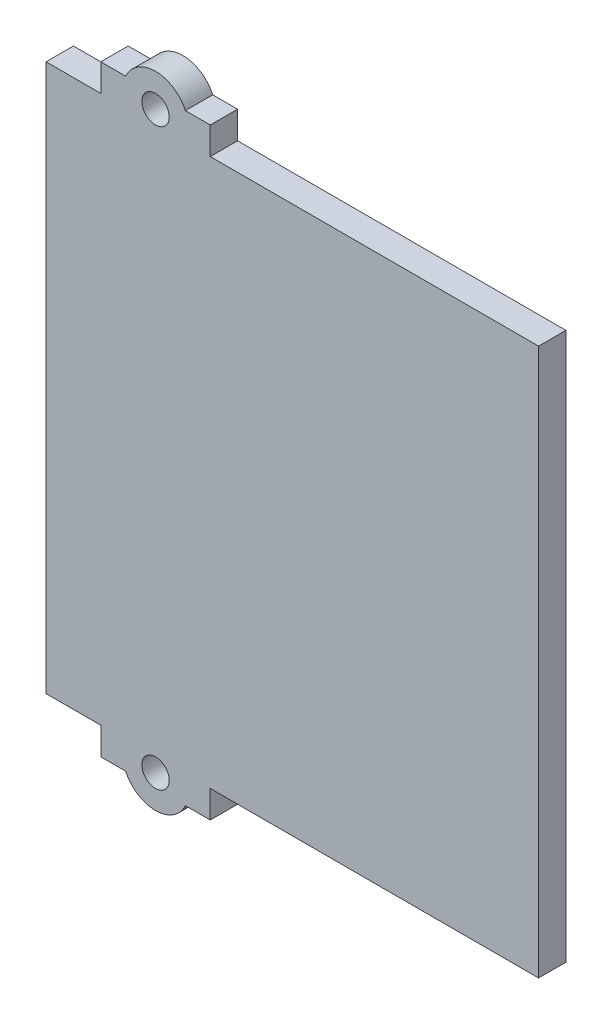
ISO-10303-21;
HEADER;
FILE_DESCRIPTION(('STEP AP214'),'2;1');
FILE_NAME('part.step','',(''),(''),'','','');
FILE_SCHEMA(('AUTOMOTIVE_DESIGN { 1 0 10303 214 1 1 1 1 }'));
ENDSEC;
DATA;
#1=APPLICATION_CONTEXT('core data for automotive mechanical design processes');
#2=APPLICATION_PROTOCOL_DEFINITION('international standard','automotive_design',2000,#1);
#3=PRODUCT_CONTEXT('',#1,'mechanical');
#4=PRODUCT('Part','Part','',(#3));
#5=PRODUCT_RELATED_PRODUCT_CATEGORY('part','',(#4));
#6=PRODUCT_DEFINITION_FORMATION('','',#4);
#7=PRODUCT_DEFINITION_CONTEXT('part definition',#1,'design');
#8=PRODUCT_DEFINITION('design','',#6,#7);
#9=PRODUCT_DEFINITION_SHAPE('','',#8);
#10=(LENGTH_UNIT() NAMED_UNIT(*) SI_UNIT(.MILLI.,.METRE.));
#11=(NAMED_UNIT(*) PLANE_ANGLE_UNIT() SI_UNIT($,.RADIAN.));
#12=(NAMED_UNIT(*) SI_UNIT($,.STERADIAN.) SOLID_ANGLE_UNIT());
#13=UNCERTAINTY_MEASURE_WITH_UNIT(LENGTH_MEASURE(1.E-05),#10,'distance_accuracy_value','');
#14=(GEOMETRIC_REPRESENTATION_CONTEXT(3) GLOBAL_UNCERTAINTY_ASSIGNED_CONTEXT((#13)) GLOBAL_UNIT_ASSIGNED_CONTEXT((#10,
#11,#12)) REPRESENTATION_CONTEXT('',''));
#15=CARTESIAN_POINT('',(0.,0.,0.));
#16=DIRECTION('',(0.,0.,1.));
#17=DIRECTION('',(1.,0.,0.));
#18=AXIS2_PLACEMENT_3D('',#15,#16,#17);
#19=CARTESIAN_POINT('',(0.,-55.,0.));
#20=DIRECTION('',(0.,1.,0.));
#21=DIRECTION('',(0.,0.,-1.));
#22=AXIS2_PLACEMENT_3D('',#19,#20,#21);
#23=PLANE('',#22);
#24=DIRECTION('',(0.,0.,1.));
#25=VECTOR('',#24,1.);
#26=CARTESIAN_POINT('',(-30.4543560573178,-55.,0.));
#27=LINE('',#26,#25);
#28=CARTESIAN_POINT('',(-30.4543560573178,-55.,5.));
#29=VERTEX_POINT('',#28);
#30=CARTESIAN_POINT('',(-30.4543560573178,-55.,0.));
#31=VERTEX_POINT('',#30);
#32=EDGE_CURVE('E11',#29,#31,#27,.F.);
#33=ORIENTED_EDGE('',*,*,#32,.F.);
#34=DIRECTION('',(1.,0.,0.));
#35=VECTOR('',#34,1.);
#36=CARTESIAN_POINT('',(-35.,-55.,5.));
#37=LINE('',#36,#35);
#38=CARTESIAN_POINT('',(-35.,-55.,5.));
#39=VERTEX_POINT('',#38);
#40=EDGE_CURVE('E159',#39,#29,#37,.T.);
#41=ORIENTED_EDGE('',*,*,#40,.F.);
#42=DIRECTION('',(0.,0.,1.));
#43=VECTOR('',#42,1.);
#44=CARTESIAN_POINT('',(-35.,-55.,5.));
#45=LINE('',#44,#43);
#46=CARTESIAN_POINT('',(-35.,-55.,0.));
#47=VERTEX_POINT('',#46);
#48=EDGE_CURVE('E180',#47,#39,#45,.T.);
#49=ORIENTED_EDGE('',*,*,#48,.F.);
#50=DIRECTION('',(-1.,0.,0.));
#51=VECTOR('',#50,1.);
#52=CARTESIAN_POINT('',(-35.,-55.,0.));
#53=LINE('',#52,#51);
#54=EDGE_CURVE('E160',#31,#47,#53,.T.);
#55=ORIENTED_EDGE('',*,*,#54,.F.);
#56=EDGE_LOOP('',(#33,#41,#49,#55));
#57=FACE_BOUND('',#56,.T.);
#58=ADVANCED_FACE('F37',(#57),#23,.F.);
#59=DIRECTION('',(0.,0.,1.));
#60=VECTOR('',#59,1.);
#61=CARTESIAN_POINT('',(-19.5456439426821,-55.,0.));
#62=LINE('',#61,#60);
#63=CARTESIAN_POINT('',(-19.5456439426821,-55.,0.));
#64=VERTEX_POINT('',#63);
#65=CARTESIAN_POINT('',(-19.5456439426821,-55.,5.));
#66=VERTEX_POINT('',#65);
#67=EDGE_CURVE('E45',#64,#66,#62,.T.);
#68=ORIENTED_EDGE('',*,*,#67,.F.);
#69=CARTESIAN_POINT('',(-15.,-55.,0.));
#70=VERTEX_POINT('',#69);
#71=EDGE_CURVE('E275',#70,#64,#53,.T.);
#72=ORIENTED_EDGE('',*,*,#71,.F.);
#73=DIRECTION('',(0.,0.,-1.));
#74=VECTOR('',#73,1.);
#75=CARTESIAN_POINT('',(-15.,-55.,5.));
#76=LINE('',#75,#74);
#77=CARTESIAN_POINT('',(-15.,-55.,5.));
#78=VERTEX_POINT('',#77);
#79=EDGE_CURVE('E170',#78,#70,#76,.T.);
#80=ORIENTED_EDGE('',*,*,#79,.F.);
#81=EDGE_CURVE('E166',#66,#78,#37,.T.);
#82=ORIENTED_EDGE('',*,*,#81,.F.);
#83=EDGE_LOOP('',(#68,#72,#80,#82));
#84=FACE_BOUND('',#83,.T.);
#85=ADVANCED_FACE('F313',(#84),#23,.F.);
#86=CARTESIAN_POINT('',(0.,55.,0.));
#87=DIRECTION('',(0.,-1.,0.));
#88=DIRECTION('',(0.,0.,-1.));
#89=AXIS2_PLACEMENT_3D('',#86,#87,#88);
#90=PLANE('',#89);
#91=DIRECTION('',(-1.,0.,0.));
#92=VECTOR('',#91,1.);
#93=CARTESIAN_POINT('',(-35.,55.,0.));
#94=LINE('',#93,#92);
#95=CARTESIAN_POINT('',(-15.,55.,0.));
#96=VERTEX_POINT('',#95);
#97=CARTESIAN_POINT('',(-19.5456439426821,55.,0.));
#98=VERTEX_POINT('',#97);
#99=EDGE_CURVE('E198',#96,#98,#94,.T.);
#100=ORIENTED_EDGE('',*,*,#99,.T.);
#101=DIRECTION('',(0.,0.,1.));
#102=VECTOR('',#101,1.);
#103=CARTESIAN_POINT('',(-19.5456439426821,55.,0.));
#104=LINE('',#103,#102);
#105=CARTESIAN_POINT('',(-19.5456439426821,55.,5.));
#106=VERTEX_POINT('',#105);
#107=EDGE_CURVE('E253',#98,#106,#104,.T.);
#108=ORIENTED_EDGE('',*,*,#107,.T.);
#109=DIRECTION('',(1.,0.,0.));
#110=VECTOR('',#109,1.);
#111=CARTESIAN_POINT('',(-35.,55.,5.));
#112=LINE('',#111,#110);
#113=CARTESIAN_POINT('',(-15.,55.,5.));
#114=VERTEX_POINT('',#113);
#115=EDGE_CURVE('E191',#106,#114,#112,.T.);
#116=ORIENTED_EDGE('',*,*,#115,.T.);
#117=DIRECTION('',(0.,0.,-1.));
#118=VECTOR('',#117,1.);
#119=CARTESIAN_POINT('',(-15.,55.,5.));
#120=LINE('',#119,#118);
#121=EDGE_CURVE('E195',#114,#96,#120,.T.);
#122=ORIENTED_EDGE('',*,*,#121,.T.);
#123=EDGE_LOOP('',(#100,#108,#116,#122));
#124=FACE_BOUND('',#123,.T.);
#125=ADVANCED_FACE('F258',(#124),#90,.F.);
#126=CARTESIAN_POINT('',(45.,-50.,5.));
#127=DIRECTION('',(0.,1.,0.));
#128=DIRECTION('',(-1.,0.,0.));
#129=AXIS2_PLACEMENT_3D('',#126,#127,#128);
#130=PLANE('',#129);
#131=DIRECTION('',(1.,0.,0.));
#132=VECTOR('',#131,1.);
#133=CARTESIAN_POINT('',(45.,-50.,0.));
#134=LINE('',#133,#132);
#135=CARTESIAN_POINT('',(-45.,-50.,0.));
#136=VERTEX_POINT('',#135);
#137=CARTESIAN_POINT('',(-35.,-50.,0.));
#138=VERTEX_POINT('',#137);
#139=EDGE_CURVE('E234',#136,#138,#134,.T.);
#140=ORIENTED_EDGE('',*,*,#139,.T.);
#141=DIRECTION('',(0.,0.,1.));
#142=VECTOR('',#141,1.);
#143=CARTESIAN_POINT('',(-35.,-50.,5.));
#144=LINE('',#143,#142);
#145=CARTESIAN_POINT('',(-35.,-50.,5.));
#146=VERTEX_POINT('',#145);
#147=EDGE_CURVE('E174',#138,#146,#144,.T.);
#148=ORIENTED_EDGE('',*,*,#147,.T.);
#149=DIRECTION('',(1.,0.,0.));
#150=VECTOR('',#149,1.);
#151=CARTESIAN_POINT('',(45.,-50.,5.));
#152=LINE('',#151,#150);
#153=CARTESIAN_POINT('',(-45.,-50.,5.));
#154=VERTEX_POINT('',#153);
#155=EDGE_CURVE('E222',#154,#146,#152,.T.);
#156=ORIENTED_EDGE('',*,*,#155,.F.);
#157=DIRECTION('',(0.,0.,-1.));
#158=VECTOR('',#157,1.);
#159=CARTESIAN_POINT('',(-45.,-50.,5.));
#160=LINE('',#159,#158);
#161=EDGE_CURVE('E249',#154,#136,#160,.T.);
#162=ORIENTED_EDGE('',*,*,#161,.T.);
#163=EDGE_LOOP('',(#140,#148,#156,#162));
#164=FACE_BOUND('',#163,.T.);
#165=ADVANCED_FACE('F286',(#164),#130,.F.);
#166=CARTESIAN_POINT('',(45.,50.,5.));
#167=DIRECTION('',(0.,-1.,0.));
#168=DIRECTION('',(1.,0.,0.));
#169=AXIS2_PLACEMENT_3D('',#166,#167,#168);
#170=PLANE('',#169);
#171=DIRECTION('',(0.,0.,1.));
#172=VECTOR('',#171,1.);
#173=CARTESIAN_POINT('',(-35.,50.,5.));
#174=LINE('',#173,#172);
#175=CARTESIAN_POINT('',(-35.,50.,0.));
#176=VERTEX_POINT('',#175);
#177=CARTESIAN_POINT('',(-35.,50.,5.));
#178=VERTEX_POINT('',#177);
#179=EDGE_CURVE('E187',#176,#178,#174,.T.);
#180=ORIENTED_EDGE('',*,*,#179,.F.);
#181=DIRECTION('',(-1.,0.,0.));
#182=VECTOR('',#181,1.);
#183=CARTESIAN_POINT('',(45.,50.,0.));
#184=LINE('',#183,#182);
#185=CARTESIAN_POINT('',(-45.,50.,0.));
#186=VERTEX_POINT('',#185);
#187=EDGE_CURVE('E239',#176,#186,#184,.T.);
#188=ORIENTED_EDGE('',*,*,#187,.T.);
#189=DIRECTION('',(0.,0.,-1.));
#190=VECTOR('',#189,1.);
#191=CARTESIAN_POINT('',(-45.,50.,5.));
#192=LINE('',#191,#190);
#193=CARTESIAN_POINT('',(-45.,50.,5.));
#194=VERTEX_POINT('',#193);
#195=EDGE_CURVE('E230',#194,#186,#192,.T.);
#196=ORIENTED_EDGE('',*,*,#195,.F.);
#197=DIRECTION('',(-1.,0.,0.));
#198=VECTOR('',#197,1.);
#199=CARTESIAN_POINT('',(45.,50.,5.));
#200=LINE('',#199,#198);
#201=EDGE_CURVE('E226',#178,#194,#200,.T.);
#202=ORIENTED_EDGE('',*,*,#201,.F.);
#203=EDGE_LOOP('',(#180,#188,#196,#202));
#204=FACE_BOUND('',#203,.T.);
#205=ADVANCED_FACE('F295',(#204),#170,.F.);
#206=DIRECTION('',(0.,0.,-1.));
#207=VECTOR('',#206,1.);
#208=CARTESIAN_POINT('',(-15.,50.,5.));
#209=LINE('',#208,#207);
#210=CARTESIAN_POINT('',(-15.,50.,5.));
#211=VERTEX_POINT('',#210);
#212=CARTESIAN_POINT('',(-15.,50.,0.));
#213=VERTEX_POINT('',#212);
#214=EDGE_CURVE('E192',#211,#213,#209,.T.);
#215=ORIENTED_EDGE('',*,*,#214,.F.);
#216=CARTESIAN_POINT('',(45.,50.,5.));
#217=VERTEX_POINT('',#216);
#218=EDGE_CURVE('E227',#217,#211,#200,.T.);
#219=ORIENTED_EDGE('',*,*,#218,.F.);
#220=DIRECTION('',(0.,0.,-1.));
#221=VECTOR('',#220,1.);
#222=CARTESIAN_POINT('',(45.,50.,5.));
#223=LINE('',#222,#221);
#224=CARTESIAN_POINT('',(45.,50.,0.));
#225=VERTEX_POINT('',#224);
#226=EDGE_CURVE('E243',#217,#225,#223,.T.);
#227=ORIENTED_EDGE('',*,*,#226,.T.);
#228=EDGE_CURVE('E221',#225,#213,#184,.T.);
#229=ORIENTED_EDGE('',*,*,#228,.T.);
#230=EDGE_LOOP('',(#215,#219,#227,#229));
#231=FACE_BOUND('',#230,.T.);
#232=ADVANCED_FACE('F345',(#231),#170,.F.);
#233=CARTESIAN_POINT('',(-45.,50.,5.));
#234=DIRECTION('',(1.,0.,0.));
#235=DIRECTION('',(0.,1.,0.));
#236=AXIS2_PLACEMENT_3D('',#233,#234,#235);
#237=PLANE('',#236);
#238=DIRECTION('',(0.,-1.,0.));
#239=VECTOR('',#238,1.);
#240=CARTESIAN_POINT('',(-45.,50.,0.));
#241=LINE('',#240,#239);
#242=EDGE_CURVE('E216',#186,#136,#241,.T.);
#243=ORIENTED_EDGE('',*,*,#242,.T.);
#244=ORIENTED_EDGE('',*,*,#161,.F.);
#245=DIRECTION('',(0.,-1.,0.));
#246=VECTOR('',#245,1.);
#247=CARTESIAN_POINT('',(-45.,50.,5.));
#248=LINE('',#247,#246);
#249=EDGE_CURVE('E217',#194,#154,#248,.T.);
#250=ORIENTED_EDGE('',*,*,#249,.F.);
#251=ORIENTED_EDGE('',*,*,#195,.T.);
#252=EDGE_LOOP('',(#243,#244,#250,#251));
#253=FACE_BOUND('',#252,.T.);
#254=ADVANCED_FACE('F39',(#253),#237,.F.);
#255=CARTESIAN_POINT('',(-15.,-50.,5.));
#256=VERTEX_POINT('',#255);
#257=CARTESIAN_POINT('',(45.,-50.,5.));
#258=VERTEX_POINT('',#257);
#259=EDGE_CURVE('E220',#256,#258,#152,.T.);
#260=ORIENTED_EDGE('',*,*,#259,.F.);
#261=DIRECTION('',(0.,0.,-1.));
#262=VECTOR('',#261,1.);
#263=CARTESIAN_POINT('',(-15.,-50.,5.));
#264=LINE('',#263,#262);
#265=CARTESIAN_POINT('',(-15.,-50.,0.));
#266=VERTEX_POINT('',#265);
#267=EDGE_CURVE('E177',#256,#266,#264,.T.);
#268=ORIENTED_EDGE('',*,*,#267,.T.);
#269=CARTESIAN_POINT('',(45.,-50.,0.));
#270=VERTEX_POINT('',#269);
#271=EDGE_CURVE('E233',#266,#270,#134,.T.);
#272=ORIENTED_EDGE('',*,*,#271,.T.);
#273=DIRECTION('',(0.,0.,-1.));
#274=VECTOR('',#273,1.);
#275=CARTESIAN_POINT('',(45.,-50.,5.));
#276=LINE('',#275,#274);
#277=EDGE_CURVE('E246',#258,#270,#276,.T.);
#278=ORIENTED_EDGE('',*,*,#277,.F.);
#279=EDGE_LOOP('',(#260,#268,#272,#278));
#280=FACE_BOUND('',#279,.T.);
#281=ADVANCED_FACE('F336',(#280),#130,.F.);
#282=CARTESIAN_POINT('',(45.,50.,5.));
#283=DIRECTION('',(-1.,0.,0.));
#284=DIRECTION('',(0.,-1.,0.));
#285=AXIS2_PLACEMENT_3D('',#282,#283,#284);
#286=PLANE('',#285);
#287=DIRECTION('',(0.,1.,0.));
#288=VECTOR('',#287,1.);
#289=CARTESIAN_POINT('',(45.,50.,0.));
#290=LINE('',#289,#288);
#291=EDGE_CURVE('E237',#270,#225,#290,.T.);
#292=ORIENTED_EDGE('',*,*,#291,.T.);
#293=ORIENTED_EDGE('',*,*,#226,.F.);
#294=DIRECTION('',(0.,1.,0.));
#295=VECTOR('',#294,1.);
#296=CARTESIAN_POINT('',(45.,50.,5.));
#297=LINE('',#296,#295);
#298=EDGE_CURVE('E224',#258,#217,#297,.T.);
#299=ORIENTED_EDGE('',*,*,#298,.F.);
#300=ORIENTED_EDGE('',*,*,#277,.T.);
#301=EDGE_LOOP('',(#292,#293,#299,#300));
#302=FACE_BOUND('',#301,.T.);
#303=ADVANCED_FACE('F341',(#302),#286,.F.);
#304=CARTESIAN_POINT('',(0.,0.,5.));
#305=DIRECTION('',(0.,0.,-1.));
#306=DIRECTION('',(-1.,0.,0.));
#307=AXIS2_PLACEMENT_3D('',#304,#305,#306);
#308=PLANE('',#307);
#309=CARTESIAN_POINT('',(-25.,-52.5,5.));
#310=DIRECTION('',(0.,0.,-1.));
#311=DIRECTION('',(1.,0.,0.));
#312=AXIS2_PLACEMENT_3D('',#309,#310,#311);
#313=CIRCLE('',#312,2.50000000000001);
#314=CARTESIAN_POINT('',(-22.5,-52.5,5.));
#315=VERTEX_POINT('',#314);
#316=EDGE_CURVE('E511',#315,#315,#313,.T.);
#317=ORIENTED_EDGE('',*,*,#316,.T.);
#318=EDGE_LOOP('',(#317));
#319=FACE_BOUND('',#318,.T.);
#320=ORIENTED_EDGE('',*,*,#40,.T.);
#321=CARTESIAN_POINT('',(-25.,-52.5,5.));
#322=DIRECTION('',(0.,0.,-1.));
#323=DIRECTION('',(1.,0.,0.));
#324=AXIS2_PLACEMENT_3D('',#321,#322,#323);
#325=CIRCLE('',#324,6.);
#326=EDGE_CURVE('E52',#66,#29,#325,.T.);
#327=ORIENTED_EDGE('',*,*,#326,.F.);
#328=ORIENTED_EDGE('',*,*,#81,.T.);
#329=DIRECTION('',(0.,1.,0.));
#330=VECTOR('',#329,1.);
#331=CARTESIAN_POINT('',(-15.,-55.,5.));
#332=LINE('',#331,#330);
#333=EDGE_CURVE('E168',#78,#256,#332,.T.);
#334=ORIENTED_EDGE('',*,*,#333,.T.);
#335=ORIENTED_EDGE('',*,*,#259,.T.);
#336=ORIENTED_EDGE('',*,*,#298,.T.);
#337=ORIENTED_EDGE('',*,*,#218,.T.);
#338=DIRECTION('',(0.,-1.,0.));
#339=VECTOR('',#338,1.);
#340=CARTESIAN_POINT('',(-15.,55.,5.));
#341=LINE('',#340,#339);
#342=EDGE_CURVE('E210',#114,#211,#341,.T.);
#343=ORIENTED_EDGE('',*,*,#342,.F.);
#344=ORIENTED_EDGE('',*,*,#115,.F.);
#345=CARTESIAN_POINT('',(-25.,52.5,5.));
#346=DIRECTION('',(0.,0.,1.));
#347=DIRECTION('',(1.,0.,0.));
#348=AXIS2_PLACEMENT_3D('',#345,#346,#347);
#349=CIRCLE('',#348,6.);
#350=CARTESIAN_POINT('',(-30.4543560573178,55.,5.));
#351=VERTEX_POINT('',#350);
#352=EDGE_CURVE('E265',#106,#351,#349,.T.);
#353=ORIENTED_EDGE('',*,*,#352,.T.);
#354=CARTESIAN_POINT('',(-35.,55.,5.));
#355=VERTEX_POINT('',#354);
#356=EDGE_CURVE('E193',#355,#351,#112,.T.);
#357=ORIENTED_EDGE('',*,*,#356,.F.);
#358=DIRECTION('',(0.,-1.,0.));
#359=VECTOR('',#358,1.);
#360=CARTESIAN_POINT('',(-35.,55.,5.));
#361=LINE('',#360,#359);
#362=EDGE_CURVE('E213',#355,#178,#361,.T.);
#363=ORIENTED_EDGE('',*,*,#362,.T.);
#364=ORIENTED_EDGE('',*,*,#201,.T.);
#365=ORIENTED_EDGE('',*,*,#249,.T.);
#366=ORIENTED_EDGE('',*,*,#155,.T.);
#367=DIRECTION('',(0.,1.,0.));
#368=VECTOR('',#367,1.);
#369=CARTESIAN_POINT('',(-35.,-55.,5.));
#370=LINE('',#369,#368);
#371=EDGE_CURVE('E164',#39,#146,#370,.T.);
#372=ORIENTED_EDGE('',*,*,#371,.F.);
#373=EDGE_LOOP('',(#320,#327,#328,#334,#335,#336,#337,#343,#344,#353,#357,#363,#364,#365,#366,#372));
#374=FACE_BOUND('',#373,.T.);
#375=CARTESIAN_POINT('',(-25.,52.5,5.));
#376=DIRECTION('',(0.,0.,1.));
#377=DIRECTION('',(1.,0.,0.));
#378=AXIS2_PLACEMENT_3D('',#375,#376,#377);
#379=CIRCLE('',#378,2.50000000000001);
#380=CARTESIAN_POINT('',(-22.5,52.5,5.));
#381=VERTEX_POINT('',#380);
#382=EDGE_CURVE('E271',#381,#381,#379,.T.);
#383=ORIENTED_EDGE('',*,*,#382,.F.);
#384=EDGE_LOOP('',(#383));
#385=FACE_BOUND('',#384,.T.);
#386=ADVANCED_FACE('F161',(#319,#374,#385),#308,.F.);
#387=CARTESIAN_POINT('',(0.,0.,0.));
#388=DIRECTION('',(0.,0.,-1.));
#389=DIRECTION('',(-1.,0.,0.));
#390=AXIS2_PLACEMENT_3D('',#387,#388,#389);
#391=PLANE('',#390);
#392=CARTESIAN_POINT('',(-25.,-52.5,0.));
#393=DIRECTION('',(0.,0.,-1.));
#394=DIRECTION('',(1.,0.,0.));
#395=AXIS2_PLACEMENT_3D('',#392,#393,#394);
#396=CIRCLE('',#395,2.50000000000001);
#397=CARTESIAN_POINT('',(-22.5,-52.5,0.));
#398=VERTEX_POINT('',#397);
#399=EDGE_CURVE('E153',#398,#398,#396,.T.);
#400=ORIENTED_EDGE('',*,*,#399,.F.);
#401=EDGE_LOOP('',(#400));
#402=FACE_BOUND('',#401,.T.);
#403=CARTESIAN_POINT('',(-25.,52.5,0.));
#404=DIRECTION('',(0.,0.,1.));
#405=DIRECTION('',(1.,0.,0.));
#406=AXIS2_PLACEMENT_3D('',#403,#404,#405);
#407=CIRCLE('',#406,2.50000000000001);
#408=CARTESIAN_POINT('',(-22.5,52.5,0.));
#409=VERTEX_POINT('',#408);
#410=EDGE_CURVE('E267',#409,#409,#407,.T.);
#411=ORIENTED_EDGE('',*,*,#410,.T.);
#412=EDGE_LOOP('',(#411));
#413=FACE_BOUND('',#412,.T.);
#414=ORIENTED_EDGE('',*,*,#71,.T.);
#415=CARTESIAN_POINT('',(-25.,-52.5,0.));
#416=DIRECTION('',(0.,0.,-1.));
#417=DIRECTION('',(1.,0.,0.));
#418=AXIS2_PLACEMENT_3D('',#415,#416,#417);
#419=CIRCLE('',#418,6.);
#420=EDGE_CURVE('E152',#64,#31,#419,.T.);
#421=ORIENTED_EDGE('',*,*,#420,.T.);
#422=ORIENTED_EDGE('',*,*,#54,.T.);
#423=DIRECTION('',(0.,1.,0.));
#424=VECTOR('',#423,1.);
#425=CARTESIAN_POINT('',(-35.,-55.,0.));
#426=LINE('',#425,#424);
#427=EDGE_CURVE('E185',#47,#138,#426,.T.);
#428=ORIENTED_EDGE('',*,*,#427,.T.);
#429=ORIENTED_EDGE('',*,*,#139,.F.);
#430=ORIENTED_EDGE('',*,*,#242,.F.);
#431=ORIENTED_EDGE('',*,*,#187,.F.);
#432=DIRECTION('',(0.,-1.,0.));
#433=VECTOR('',#432,1.);
#434=CARTESIAN_POINT('',(-35.,55.,0.));
#435=LINE('',#434,#433);
#436=CARTESIAN_POINT('',(-35.,55.,0.));
#437=VERTEX_POINT('',#436);
#438=EDGE_CURVE('E200',#437,#176,#435,.T.);
#439=ORIENTED_EDGE('',*,*,#438,.F.);
#440=CARTESIAN_POINT('',(-30.4543560573178,55.,0.));
#441=VERTEX_POINT('',#440);
#442=EDGE_CURVE('E197',#441,#437,#94,.T.);
#443=ORIENTED_EDGE('',*,*,#442,.F.);
#444=CARTESIAN_POINT('',(-25.,52.5,0.));
#445=DIRECTION('',(0.,0.,1.));
#446=DIRECTION('',(1.,0.,0.));
#447=AXIS2_PLACEMENT_3D('',#444,#445,#446);
#448=CIRCLE('',#447,6.);
#449=EDGE_CURVE('E178',#98,#441,#448,.T.);
#450=ORIENTED_EDGE('',*,*,#449,.F.);
#451=ORIENTED_EDGE('',*,*,#99,.F.);
#452=DIRECTION('',(0.,-1.,0.));
#453=VECTOR('',#452,1.);
#454=CARTESIAN_POINT('',(-15.,55.,0.));
#455=LINE('',#454,#453);
#456=EDGE_CURVE('E207',#96,#213,#455,.T.);
#457=ORIENTED_EDGE('',*,*,#456,.T.);
#458=ORIENTED_EDGE('',*,*,#228,.F.);
#459=ORIENTED_EDGE('',*,*,#291,.F.);
#460=ORIENTED_EDGE('',*,*,#271,.F.);
#461=DIRECTION('',(0.,1.,0.));
#462=VECTOR('',#461,1.);
#463=CARTESIAN_POINT('',(-15.,-55.,0.));
#464=LINE('',#463,#462);
#465=EDGE_CURVE('E183',#70,#266,#464,.T.);
#466=ORIENTED_EDGE('',*,*,#465,.F.);
#467=EDGE_LOOP('',(#414,#421,#422,#428,#429,#430,#431,#439,#443,#450,#451,#457,#458,#459,#460,#466));
#468=FACE_BOUND('',#467,.T.);
#469=ADVANCED_FACE('F281',(#402,#413,#468),#391,.T.);
#470=CARTESIAN_POINT('',(-35.,55.,5.));
#471=DIRECTION('',(1.,0.,0.));
#472=DIRECTION('',(0.,0.,-1.));
#473=AXIS2_PLACEMENT_3D('',#470,#471,#472);
#474=PLANE('',#473);
#475=ORIENTED_EDGE('',*,*,#179,.T.);
#476=ORIENTED_EDGE('',*,*,#362,.F.);
#477=DIRECTION('',(0.,0.,1.));
#478=VECTOR('',#477,1.);
#479=CARTESIAN_POINT('',(-35.,55.,5.));
#480=LINE('',#479,#478);
#481=EDGE_CURVE('E188',#437,#355,#480,.T.);
#482=ORIENTED_EDGE('',*,*,#481,.F.);
#483=ORIENTED_EDGE('',*,*,#438,.T.);
#484=EDGE_LOOP('',(#475,#476,#482,#483));
#485=FACE_BOUND('',#484,.T.);
#486=ADVANCED_FACE('F298',(#485),#474,.F.);
#487=CARTESIAN_POINT('',(-15.,55.,5.));
#488=DIRECTION('',(-1.,0.,0.));
#489=DIRECTION('',(0.,0.,1.));
#490=AXIS2_PLACEMENT_3D('',#487,#488,#489);
#491=PLANE('',#490);
#492=ORIENTED_EDGE('',*,*,#214,.T.);
#493=ORIENTED_EDGE('',*,*,#456,.F.);
#494=ORIENTED_EDGE('',*,*,#121,.F.);
#495=ORIENTED_EDGE('',*,*,#342,.T.);
#496=EDGE_LOOP('',(#492,#493,#494,#495));
#497=FACE_BOUND('',#496,.T.);
#498=ADVANCED_FACE('F302',(#497),#491,.F.);
#499=ORIENTED_EDGE('',*,*,#356,.T.);
#500=DIRECTION('',(0.,0.,1.));
#501=VECTOR('',#500,1.);
#502=CARTESIAN_POINT('',(-30.4543560573178,55.,0.));
#503=LINE('',#502,#501);
#504=EDGE_CURVE('E60',#351,#441,#503,.F.);
#505=ORIENTED_EDGE('',*,*,#504,.T.);
#506=ORIENTED_EDGE('',*,*,#442,.T.);
#507=ORIENTED_EDGE('',*,*,#481,.T.);
#508=EDGE_LOOP('',(#499,#505,#506,#507));
#509=FACE_BOUND('',#508,.T.);
#510=ADVANCED_FACE('F300',(#509),#90,.F.);
#511=CARTESIAN_POINT('',(-35.,-55.,5.));
#512=DIRECTION('',(-1.,0.,0.));
#513=DIRECTION('',(0.,0.,1.));
#514=AXIS2_PLACEMENT_3D('',#511,#512,#513);
#515=PLANE('',#514);
#516=ORIENTED_EDGE('',*,*,#147,.F.);
#517=ORIENTED_EDGE('',*,*,#427,.F.);
#518=ORIENTED_EDGE('',*,*,#48,.T.);
#519=ORIENTED_EDGE('',*,*,#371,.T.);
#520=EDGE_LOOP('',(#516,#517,#518,#519));
#521=FACE_BOUND('',#520,.T.);
#522=ADVANCED_FACE('F284',(#521),#515,.T.);
#523=CARTESIAN_POINT('',(-15.,-55.,5.));
#524=DIRECTION('',(1.,0.,0.));
#525=DIRECTION('',(0.,0.,-1.));
#526=AXIS2_PLACEMENT_3D('',#523,#524,#525);
#527=PLANE('',#526);
#528=ORIENTED_EDGE('',*,*,#267,.F.);
#529=ORIENTED_EDGE('',*,*,#333,.F.);
#530=ORIENTED_EDGE('',*,*,#79,.T.);
#531=ORIENTED_EDGE('',*,*,#465,.T.);
#532=EDGE_LOOP('',(#528,#529,#530,#531));
#533=FACE_BOUND('',#532,.T.);
#534=ADVANCED_FACE('F308',(#533),#527,.T.);
#535=CARTESIAN_POINT('',(-25.,52.5,0.));
#536=DIRECTION('',(0.,0.,1.));
#537=DIRECTION('',(1.,0.,0.));
#538=AXIS2_PLACEMENT_3D('',#535,#536,#537);
#539=CYLINDRICAL_SURFACE('',#538,6.);
#540=ORIENTED_EDGE('',*,*,#107,.F.);
#541=ORIENTED_EDGE('',*,*,#449,.T.);
#542=ORIENTED_EDGE('',*,*,#504,.F.);
#543=ORIENTED_EDGE('',*,*,#352,.F.);
#544=EDGE_LOOP('',(#540,#541,#542,#543));
#545=FACE_BOUND('',#544,.T.);
#546=ADVANCED_FACE('F266',(#545),#539,.T.);
#547=CARTESIAN_POINT('',(-25.,52.5,0.));
#548=DIRECTION('',(0.,0.,1.));
#549=DIRECTION('',(1.,0.,0.));
#550=AXIS2_PLACEMENT_3D('',#547,#548,#549);
#551=CYLINDRICAL_SURFACE('',#550,2.50000000000001);
#552=ORIENTED_EDGE('',*,*,#410,.F.);
#553=EDGE_LOOP('',(#552));
#554=FACE_BOUND('',#553,.T.);
#555=ORIENTED_EDGE('',*,*,#382,.T.);
#556=EDGE_LOOP('',(#555));
#557=FACE_BOUND('',#556,.T.);
#558=ADVANCED_FACE('F328',(#554,#557),#551,.F.);
#559=CARTESIAN_POINT('',(-25.,-52.5,0.));
#560=DIRECTION('',(0.,0.,1.));
#561=DIRECTION('',(1.,0.,0.));
#562=AXIS2_PLACEMENT_3D('',#559,#560,#561);
#563=CYLINDRICAL_SURFACE('',#562,6.);
#564=ORIENTED_EDGE('',*,*,#326,.T.);
#565=ORIENTED_EDGE('',*,*,#32,.T.);
#566=ORIENTED_EDGE('',*,*,#420,.F.);
#567=ORIENTED_EDGE('',*,*,#67,.T.);
#568=EDGE_LOOP('',(#564,#565,#566,#567));
#569=FACE_BOUND('',#568,.T.);
#570=ADVANCED_FACE('F148',(#569),#563,.T.);
#571=CARTESIAN_POINT('',(-25.,-52.5,0.));
#572=DIRECTION('',(0.,0.,1.));
#573=DIRECTION('',(1.,0.,0.));
#574=AXIS2_PLACEMENT_3D('',#571,#572,#573);
#575=CYLINDRICAL_SURFACE('',#574,2.50000000000001);
#576=ORIENTED_EDGE('',*,*,#399,.T.);
#577=EDGE_LOOP('',(#576));
#578=FACE_BOUND('',#577,.T.);
#579=ORIENTED_EDGE('',*,*,#316,.F.);
#580=EDGE_LOOP('',(#579));
#581=FACE_BOUND('',#580,.T.);
#582=ADVANCED_FACE('F493',(#578,#581),#575,.F.);
#583=CLOSED_SHELL('',(#58,#85,#125,#165,#205,#232,#254,#281,#303,#386,#469,#486,#498,#510,#522,
#534,#546,#558,#570,#582));
#584=MANIFOLD_SOLID_BREP('B2',#583);
#585=ADVANCED_BREP_SHAPE_REPRESENTATION('',(#18,#584),#14);
#586=SHAPE_DEFINITION_REPRESENTATION(#9,#585);
ENDSEC;
END-ISO-10303-21;
